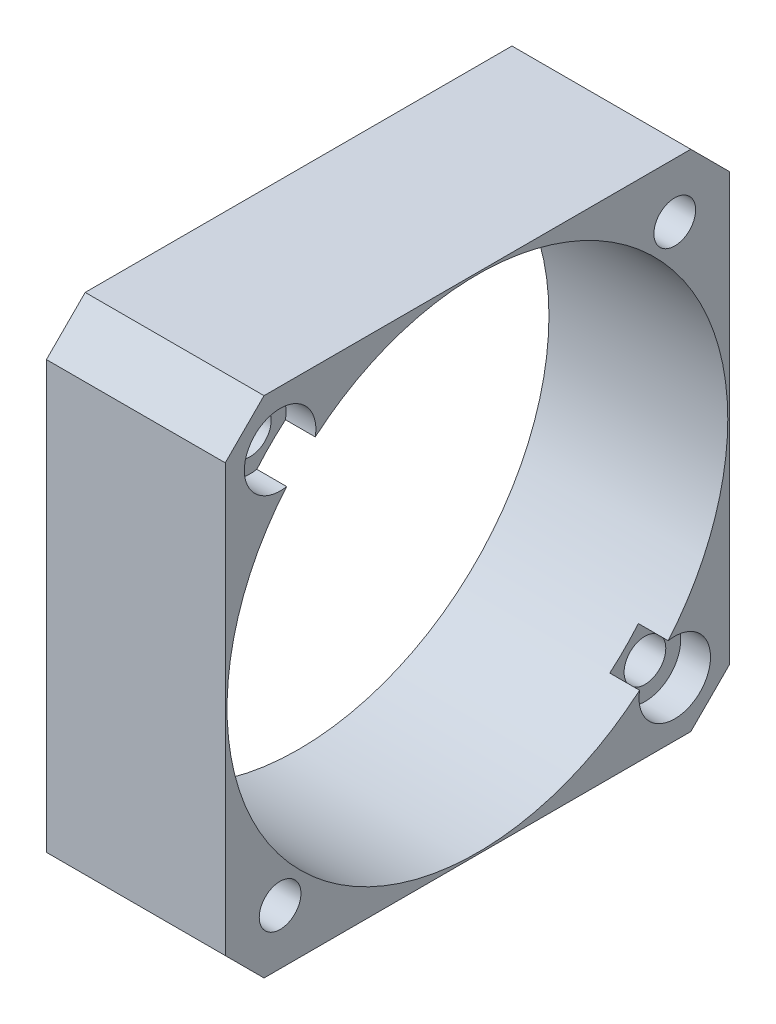
ISO-10303-21;
HEADER;
FILE_DESCRIPTION(('STEP AP214'),'2;1');
FILE_NAME('part.step','',(''),(''),'','','');
FILE_SCHEMA(('AUTOMOTIVE_DESIGN { 1 0 10303 214 1 1 1 1 }'));
ENDSEC;
DATA;
#1=APPLICATION_CONTEXT('core data for automotive mechanical design processes');
#2=APPLICATION_PROTOCOL_DEFINITION('international standard','automotive_design',2000,#1);
#3=PRODUCT_CONTEXT('',#1,'mechanical');
#4=PRODUCT('Part','Part','',(#3));
#5=PRODUCT_RELATED_PRODUCT_CATEGORY('part','',(#4));
#6=PRODUCT_DEFINITION_FORMATION('','',#4);
#7=PRODUCT_DEFINITION_CONTEXT('part definition',#1,'design');
#8=PRODUCT_DEFINITION('design','',#6,#7);
#9=PRODUCT_DEFINITION_SHAPE('','',#8);
#10=(LENGTH_UNIT() NAMED_UNIT(*) SI_UNIT(.MILLI.,.METRE.));
#11=(NAMED_UNIT(*) PLANE_ANGLE_UNIT() SI_UNIT($,.RADIAN.));
#12=(NAMED_UNIT(*) SI_UNIT($,.STERADIAN.) SOLID_ANGLE_UNIT());
#13=UNCERTAINTY_MEASURE_WITH_UNIT(LENGTH_MEASURE(1.E-05),#10,'distance_accuracy_value','');
#14=(GEOMETRIC_REPRESENTATION_CONTEXT(3) GLOBAL_UNCERTAINTY_ASSIGNED_CONTEXT((#13)) GLOBAL_UNIT_ASSIGNED_CONTEXT((#10,
#11,#12)) REPRESENTATION_CONTEXT('',''));
#15=CARTESIAN_POINT('',(0.,0.,0.));
#16=DIRECTION('',(0.,0.,1.));
#17=DIRECTION('',(1.,0.,0.));
#18=AXIS2_PLACEMENT_3D('',#15,#16,#17);
#19=CARTESIAN_POINT('',(-18.2228778596732,16.51656247788,24.8694653146279));
#20=DIRECTION('',(1.,0.,0.));
#21=DIRECTION('',(0.,0.,-1.));
#22=AXIS2_PLACEMENT_3D('',#19,#20,#21);
#23=CYLINDRICAL_SURFACE('',#22,1.75);
#24=CARTESIAN_POINT('',(-23.2228778596732,16.51656247788,24.8694653146279));
#25=DIRECTION('',(-1.,0.,0.));
#26=DIRECTION('',(0.,0.,1.));
#27=AXIS2_PLACEMENT_3D('',#24,#25,#26);
#28=CIRCLE('',#27,1.75);
#29=CARTESIAN_POINT('',(-23.2228778596732,16.51656247788,26.6194653146279));
#30=VERTEX_POINT('',#29);
#31=EDGE_CURVE('E153',#30,#30,#28,.T.);
#32=ORIENTED_EDGE('',*,*,#31,.T.);
#33=EDGE_LOOP('',(#32));
#34=FACE_BOUND('',#33,.T.);
#35=CARTESIAN_POINT('',(-10.7228778596732,16.51656247788,24.8694653146279));
#36=DIRECTION('',(1.,0.,0.));
#37=DIRECTION('',(0.,0.,-1.));
#38=AXIS2_PLACEMENT_3D('',#35,#36,#37);
#39=CIRCLE('',#38,1.75);
#40=CARTESIAN_POINT('',(-10.7228778596732,16.51656247788,23.1194653146279));
#41=VERTEX_POINT('',#40);
#42=EDGE_CURVE('E157',#41,#41,#39,.F.);
#43=ORIENTED_EDGE('',*,*,#42,.F.);
#44=EDGE_LOOP('',(#43));
#45=FACE_BOUND('',#44,.T.);
#46=ADVANCED_FACE('F36',(#34,#45),#23,.F.);
#47=CARTESIAN_POINT('',(-18.2228778596732,-16.5834375221197,-8.23053468537245));
#48=DIRECTION('',(1.,0.,0.));
#49=DIRECTION('',(0.,0.,-1.));
#50=AXIS2_PLACEMENT_3D('',#47,#48,#49);
#51=CYLINDRICAL_SURFACE('',#50,1.75);
#52=CARTESIAN_POINT('',(-23.2228778596732,-16.5834375221197,-8.23053468537245));
#53=DIRECTION('',(-1.,0.,0.));
#54=DIRECTION('',(0.,0.,1.));
#55=AXIS2_PLACEMENT_3D('',#52,#53,#54);
#56=CIRCLE('',#55,1.75);
#57=CARTESIAN_POINT('',(-23.2228778596732,-16.5834375221197,-6.48053468537244));
#58=VERTEX_POINT('',#57);
#59=EDGE_CURVE('E160',#58,#58,#56,.T.);
#60=ORIENTED_EDGE('',*,*,#59,.T.);
#61=EDGE_LOOP('',(#60));
#62=FACE_BOUND('',#61,.T.);
#63=CARTESIAN_POINT('',(-10.7228778596732,-16.5834375221197,-8.23053468537245));
#64=DIRECTION('',(1.,0.,0.));
#65=DIRECTION('',(0.,0.,-1.));
#66=AXIS2_PLACEMENT_3D('',#63,#64,#65);
#67=CIRCLE('',#66,1.75);
#68=CARTESIAN_POINT('',(-10.7228778596732,-16.5834375221197,-9.98053468537245));
#69=VERTEX_POINT('',#68);
#70=EDGE_CURVE('E144',#69,#69,#67,.F.);
#71=ORIENTED_EDGE('',*,*,#70,.F.);
#72=EDGE_LOOP('',(#71));
#73=FACE_BOUND('',#72,.T.);
#74=ADVANCED_FACE('F260',(#62,#73),#51,.F.);
#75=CARTESIAN_POINT('',(-8.22287785967319,-0.0334375221200389,-8.6805346853721));
#76=DIRECTION('',(-1.,0.,0.));
#77=DIRECTION('',(0.,0.,1.));
#78=AXIS2_PLACEMENT_3D('',#75,#76,#77);
#79=PLANE('',#78);
#80=CARTESIAN_POINT('',(-8.22287785967319,16.51656247788,24.8694653146279));
#81=DIRECTION('',(1.,0.,0.));
#82=DIRECTION('',(0.,0.,-1.));
#83=AXIS2_PLACEMENT_3D('',#80,#81,#82);
#84=CIRCLE('',#83,3.);
#85=CARTESIAN_POINT('',(-8.22287785967319,15.9671916901266,21.9201956189976));
#86=VERTEX_POINT('',#85);
#87=CARTESIAN_POINT('',(-8.22287785967319,13.5672927822497,24.3200945268745));
#88=VERTEX_POINT('',#87);
#89=EDGE_CURVE('E137',#86,#88,#84,.T.);
#90=ORIENTED_EDGE('',*,*,#89,.F.);
#91=CARTESIAN_POINT('',(-8.22287785967319,-0.0334375221200389,8.31946531462791));
#92=DIRECTION('',(1.,0.,0.));
#93=DIRECTION('',(0.,0.,-1.));
#94=AXIS2_PLACEMENT_3D('',#91,#92,#93);
#95=CIRCLE('',#94,21.);
#96=CARTESIAN_POINT('',(-8.22287785967319,-13.6341678264894,-7.68116389761898));
#97=VERTEX_POINT('',#96);
#98=EDGE_CURVE('E123',#97,#86,#95,.T.);
#99=ORIENTED_EDGE('',*,*,#98,.F.);
#100=CARTESIAN_POINT('',(-8.22287785967319,-16.5834375221197,-8.23053468537245));
#101=DIRECTION('',(1.,0.,0.));
#102=DIRECTION('',(0.,0.,-1.));
#103=AXIS2_PLACEMENT_3D('',#100,#101,#102);
#104=CIRCLE('',#103,3.);
#105=CARTESIAN_POINT('',(-8.22287785967319,-16.0340667343664,-5.28126498974214));
#106=VERTEX_POINT('',#105);
#107=EDGE_CURVE('E147',#106,#97,#104,.T.);
#108=ORIENTED_EDGE('',*,*,#107,.F.);
#109=EDGE_CURVE('E131',#88,#106,#95,.T.);
#110=ORIENTED_EDGE('',*,*,#109,.F.);
#111=EDGE_LOOP('',(#90,#99,#108,#110));
#112=FACE_BOUND('',#111,.T.);
#113=CARTESIAN_POINT('',(-8.22287785967319,-16.5834375221199,24.8694653146276));
#114=DIRECTION('',(-1.,0.,0.));
#115=DIRECTION('',(0.,0.,1.));
#116=AXIS2_PLACEMENT_3D('',#113,#114,#115);
#117=CIRCLE('',#116,1.75);
#118=CARTESIAN_POINT('',(-8.22287785967319,-16.5834375221199,26.6194653146276));
#119=VERTEX_POINT('',#118);
#120=EDGE_CURVE('E219',#119,#119,#117,.T.);
#121=ORIENTED_EDGE('',*,*,#120,.T.);
#122=EDGE_LOOP('',(#121));
#123=FACE_BOUND('',#122,.T.);
#124=CARTESIAN_POINT('',(-8.22287785967319,16.5165624778804,-8.23053468537216));
#125=DIRECTION('',(-1.,0.,0.));
#126=DIRECTION('',(0.,0.,1.));
#127=AXIS2_PLACEMENT_3D('',#124,#125,#126);
#128=CIRCLE('',#127,1.75);
#129=CARTESIAN_POINT('',(-8.22287785967319,16.5165624778804,-6.48053468537216));
#130=VERTEX_POINT('',#129);
#131=EDGE_CURVE('E215',#130,#130,#128,.T.);
#132=ORIENTED_EDGE('',*,*,#131,.T.);
#133=EDGE_LOOP('',(#132));
#134=FACE_BOUND('',#133,.T.);
#135=DIRECTION('',(0.,1.,0.));
#136=VECTOR('',#135,1.);
#137=CARTESIAN_POINT('',(-8.22287785967319,-21.18343752212,-12.8305346853721));
#138=LINE('',#137,#136);
#139=CARTESIAN_POINT('',(-8.22287785967319,-17.9307463286619,-12.8305346853721));
#140=VERTEX_POINT('',#139);
#141=CARTESIAN_POINT('',(-8.22287785967319,17.8638712844216,-12.8305346853721));
#142=VERTEX_POINT('',#141);
#143=EDGE_CURVE('E228',#140,#142,#138,.T.);
#144=ORIENTED_EDGE('',*,*,#143,.T.);
#145=DIRECTION('',(0.,-0.707106781186555,-0.70710678118654));
#146=VECTOR('',#145,1.);
#147=CARTESIAN_POINT('',(-8.22287785967319,17.8638712844216,-12.8305346853723));
#148=LINE('',#147,#146);
#149=CARTESIAN_POINT('',(-8.22287785967319,21.1165624778798,-9.57784349191421));
#150=VERTEX_POINT('',#149);
#151=EDGE_CURVE('E190',#150,#142,#148,.T.);
#152=ORIENTED_EDGE('',*,*,#151,.F.);
#153=DIRECTION('',(0.,0.,1.));
#154=VECTOR('',#153,1.);
#155=CARTESIAN_POINT('',(-8.22287785967319,21.11656247788,-12.8305346853721));
#156=LINE('',#155,#154);
#157=CARTESIAN_POINT('',(-8.22287785967319,21.11656247788,26.2167741211696));
#158=VERTEX_POINT('',#157);
#159=EDGE_CURVE('E231',#150,#158,#156,.T.);
#160=ORIENTED_EDGE('',*,*,#159,.T.);
#161=DIRECTION('',(0.,0.707106781186542,-0.707106781186553));
#162=VECTOR('',#161,1.);
#163=CARTESIAN_POINT('',(-8.22287785967319,21.1165624778801,26.2167741211696));
#164=LINE('',#163,#162);
#165=CARTESIAN_POINT('',(-8.22287785967319,17.863871284422,29.4694653146278));
#166=VERTEX_POINT('',#165);
#167=EDGE_CURVE('E59',#166,#158,#164,.T.);
#168=ORIENTED_EDGE('',*,*,#167,.F.);
#169=DIRECTION('',(0.,-1.,0.));
#170=VECTOR('',#169,1.);
#171=CARTESIAN_POINT('',(-8.22287785967319,-21.18343752212,29.4694653146279));
#172=LINE('',#171,#170);
#173=CARTESIAN_POINT('',(-8.22287785967319,-17.9307463286618,29.469465314628));
#174=VERTEX_POINT('',#173);
#175=EDGE_CURVE('E222',#166,#174,#172,.T.);
#176=ORIENTED_EDGE('',*,*,#175,.T.);
#177=DIRECTION('',(0.,0.70710678118655,0.707106781186545));
#178=VECTOR('',#177,1.);
#179=CARTESIAN_POINT('',(-8.22287785967319,-17.9307463286618,29.469465314628));
#180=LINE('',#179,#178);
#181=CARTESIAN_POINT('',(-8.22287785967319,-21.18343752212,26.2167741211699));
#182=VERTEX_POINT('',#181);
#183=EDGE_CURVE('E191',#182,#174,#180,.T.);
#184=ORIENTED_EDGE('',*,*,#183,.F.);
#185=DIRECTION('',(0.,0.,-1.));
#186=VECTOR('',#185,1.);
#187=CARTESIAN_POINT('',(-8.22287785967319,-21.18343752212,-12.8305346853721));
#188=LINE('',#187,#186);
#189=CARTESIAN_POINT('',(-8.22287785967319,-21.18343752212,-9.57784349191398));
#190=VERTEX_POINT('',#189);
#191=EDGE_CURVE('E225',#182,#190,#188,.T.);
#192=ORIENTED_EDGE('',*,*,#191,.T.);
#193=DIRECTION('',(0.,-0.707106781186548,0.707106781186548));
#194=VECTOR('',#193,1.);
#195=CARTESIAN_POINT('',(-8.22287785967319,-21.18343752212,-9.57784349191398));
#196=LINE('',#195,#194);
#197=EDGE_CURVE('E198',#140,#190,#196,.T.);
#198=ORIENTED_EDGE('',*,*,#197,.F.);
#199=EDGE_LOOP('',(#144,#152,#160,#168,#176,#184,#192,#198));
#200=FACE_BOUND('',#199,.T.);
#201=ADVANCED_FACE('F38',(#112,#123,#134,#200),#79,.F.);
#202=CARTESIAN_POINT('',(-18.2228778596732,-21.18343752212,29.4694653146279));
#203=DIRECTION('',(0.,0.,1.));
#204=DIRECTION('',(0.,-1.,0.));
#205=AXIS2_PLACEMENT_3D('',#202,#203,#204);
#206=PLANE('',#205);
#207=DIRECTION('',(1.,0.,0.));
#208=VECTOR('',#207,1.);
#209=CARTESIAN_POINT('',(-18.2228778596732,17.863871284422,29.4694653146278));
#210=LINE('',#209,#208);
#211=CARTESIAN_POINT('',(-23.2228778596732,17.863871284422,29.4694653146278));
#212=VERTEX_POINT('',#211);
#213=EDGE_CURVE('E201',#212,#166,#210,.T.);
#214=ORIENTED_EDGE('',*,*,#213,.F.);
#215=DIRECTION('',(0.,1.,0.));
#216=VECTOR('',#215,1.);
#217=CARTESIAN_POINT('',(-23.2228778596732,-17.9307463286618,29.469465314628));
#218=LINE('',#217,#216);
#219=CARTESIAN_POINT('',(-23.2228778596732,-17.9307463286618,29.469465314628));
#220=VERTEX_POINT('',#219);
#221=EDGE_CURVE('E181',#220,#212,#218,.T.);
#222=ORIENTED_EDGE('',*,*,#221,.F.);
#223=DIRECTION('',(1.,0.,0.));
#224=VECTOR('',#223,1.);
#225=CARTESIAN_POINT('',(-18.2228778596732,-17.9307463286618,29.469465314628));
#226=LINE('',#225,#224);
#227=EDGE_CURVE('E195',#220,#174,#226,.T.);
#228=ORIENTED_EDGE('',*,*,#227,.T.);
#229=ORIENTED_EDGE('',*,*,#175,.F.);
#230=EDGE_LOOP('',(#214,#222,#228,#229));
#231=FACE_BOUND('',#230,.T.);
#232=ADVANCED_FACE('F269',(#231),#206,.T.);
#233=CARTESIAN_POINT('',(-18.2228778596732,21.11656247788,-12.8305346853721));
#234=DIRECTION('',(0.,1.,0.));
#235=DIRECTION('',(0.,0.,1.));
#236=AXIS2_PLACEMENT_3D('',#233,#234,#235);
#237=PLANE('',#236);
#238=DIRECTION('',(1.,0.,0.));
#239=VECTOR('',#238,1.);
#240=CARTESIAN_POINT('',(-18.2228778596732,21.1165624778798,-9.57784349191421));
#241=LINE('',#240,#239);
#242=CARTESIAN_POINT('',(-23.2228778596732,21.1165624778798,-9.57784349191421));
#243=VERTEX_POINT('',#242);
#244=EDGE_CURVE('E206',#243,#150,#241,.T.);
#245=ORIENTED_EDGE('',*,*,#244,.F.);
#246=DIRECTION('',(0.,0.,-1.));
#247=VECTOR('',#246,1.);
#248=CARTESIAN_POINT('',(-23.2228778596732,21.1165624778801,26.2167741211696));
#249=LINE('',#248,#247);
#250=CARTESIAN_POINT('',(-23.2228778596732,21.1165624778801,26.2167741211696));
#251=VERTEX_POINT('',#250);
#252=EDGE_CURVE('E187',#251,#243,#249,.T.);
#253=ORIENTED_EDGE('',*,*,#252,.F.);
#254=DIRECTION('',(1.,0.,0.));
#255=VECTOR('',#254,1.);
#256=CARTESIAN_POINT('',(-18.2228778596732,21.1165624778801,26.2167741211696));
#257=LINE('',#256,#255);
#258=EDGE_CURVE('E194',#251,#158,#257,.T.);
#259=ORIENTED_EDGE('',*,*,#258,.T.);
#260=ORIENTED_EDGE('',*,*,#159,.F.);
#261=EDGE_LOOP('',(#245,#253,#259,#260));
#262=FACE_BOUND('',#261,.T.);
#263=ADVANCED_FACE('F281',(#262),#237,.T.);
#264=CARTESIAN_POINT('',(-18.2228778596732,-21.18343752212,-12.8305346853721));
#265=DIRECTION('',(0.,0.,-1.));
#266=DIRECTION('',(-1.,0.,0.));
#267=AXIS2_PLACEMENT_3D('',#264,#265,#266);
#268=PLANE('',#267);
#269=DIRECTION('',(1.,0.,0.));
#270=VECTOR('',#269,1.);
#271=CARTESIAN_POINT('',(-18.2228778596732,17.8638712844216,-12.8305346853723));
#272=LINE('',#271,#270);
#273=CARTESIAN_POINT('',(-23.2228778596732,17.8638712844216,-12.8305346853723));
#274=VERTEX_POINT('',#273);
#275=EDGE_CURVE('E202',#274,#142,#272,.T.);
#276=ORIENTED_EDGE('',*,*,#275,.T.);
#277=ORIENTED_EDGE('',*,*,#143,.F.);
#278=DIRECTION('',(1.,0.,0.));
#279=VECTOR('',#278,1.);
#280=CARTESIAN_POINT('',(-18.2228778596732,-17.9307463286619,-12.8305346853721));
#281=LINE('',#280,#279);
#282=CARTESIAN_POINT('',(-23.2228778596732,-17.9307463286619,-12.8305346853721));
#283=VERTEX_POINT('',#282);
#284=EDGE_CURVE('E211',#283,#140,#281,.T.);
#285=ORIENTED_EDGE('',*,*,#284,.F.);
#286=DIRECTION('',(0.,-1.,0.));
#287=VECTOR('',#286,1.);
#288=CARTESIAN_POINT('',(-23.2228778596732,17.8638712844216,-12.8305346853723));
#289=LINE('',#288,#287);
#290=EDGE_CURVE('E169',#274,#283,#289,.T.);
#291=ORIENTED_EDGE('',*,*,#290,.F.);
#292=EDGE_LOOP('',(#276,#277,#285,#291));
#293=FACE_BOUND('',#292,.T.);
#294=ADVANCED_FACE('F284',(#293),#268,.T.);
#295=CARTESIAN_POINT('',(-18.2228778596732,-21.18343752212,-12.8305346853721));
#296=DIRECTION('',(0.,-1.,0.));
#297=DIRECTION('',(0.,0.,-1.));
#298=AXIS2_PLACEMENT_3D('',#295,#296,#297);
#299=PLANE('',#298);
#300=DIRECTION('',(1.,0.,0.));
#301=VECTOR('',#300,1.);
#302=CARTESIAN_POINT('',(-18.2228778596732,-21.18343752212,26.2167741211699));
#303=LINE('',#302,#301);
#304=CARTESIAN_POINT('',(-23.2228778596732,-21.18343752212,26.2167741211699));
#305=VERTEX_POINT('',#304);
#306=EDGE_CURVE('E193',#305,#182,#303,.T.);
#307=ORIENTED_EDGE('',*,*,#306,.F.);
#308=DIRECTION('',(0.,0.,1.));
#309=VECTOR('',#308,1.);
#310=CARTESIAN_POINT('',(-23.2228778596732,-21.18343752212,-9.57784349191398));
#311=LINE('',#310,#309);
#312=CARTESIAN_POINT('',(-23.2228778596732,-21.18343752212,-9.57784349191398));
#313=VERTEX_POINT('',#312);
#314=EDGE_CURVE('E175',#313,#305,#311,.T.);
#315=ORIENTED_EDGE('',*,*,#314,.F.);
#316=DIRECTION('',(1.,0.,0.));
#317=VECTOR('',#316,1.);
#318=CARTESIAN_POINT('',(-18.2228778596732,-21.18343752212,-9.57784349191398));
#319=LINE('',#318,#317);
#320=EDGE_CURVE('E212',#313,#190,#319,.T.);
#321=ORIENTED_EDGE('',*,*,#320,.T.);
#322=ORIENTED_EDGE('',*,*,#191,.F.);
#323=EDGE_LOOP('',(#307,#315,#321,#322));
#324=FACE_BOUND('',#323,.T.);
#325=ADVANCED_FACE('F288',(#324),#299,.T.);
#326=CARTESIAN_POINT('',(-18.2228778596732,16.5165624778804,-8.23053468537216));
#327=DIRECTION('',(1.,0.,0.));
#328=DIRECTION('',(0.,0.,-1.));
#329=AXIS2_PLACEMENT_3D('',#326,#327,#328);
#330=CYLINDRICAL_SURFACE('',#329,1.75);
#331=ORIENTED_EDGE('',*,*,#131,.F.);
#332=EDGE_LOOP('',(#331));
#333=FACE_BOUND('',#332,.T.);
#334=CARTESIAN_POINT('',(-23.2228778596732,16.5165624778804,-8.23053468537216));
#335=DIRECTION('',(-1.,0.,0.));
#336=DIRECTION('',(0.,0.,1.));
#337=AXIS2_PLACEMENT_3D('',#334,#335,#336);
#338=CIRCLE('',#337,1.75);
#339=CARTESIAN_POINT('',(-23.2228778596732,16.5165624778804,-6.48053468537216));
#340=VERTEX_POINT('',#339);
#341=EDGE_CURVE('E163',#340,#340,#338,.T.);
#342=ORIENTED_EDGE('',*,*,#341,.T.);
#343=EDGE_LOOP('',(#342));
#344=FACE_BOUND('',#343,.T.);
#345=ADVANCED_FACE('F274',(#333,#344),#330,.F.);
#346=CARTESIAN_POINT('',(-18.2228778596732,-16.5834375221199,24.8694653146276));
#347=DIRECTION('',(1.,0.,0.));
#348=DIRECTION('',(0.,0.,-1.));
#349=AXIS2_PLACEMENT_3D('',#346,#347,#348);
#350=CYLINDRICAL_SURFACE('',#349,1.75);
#351=ORIENTED_EDGE('',*,*,#120,.F.);
#352=EDGE_LOOP('',(#351));
#353=FACE_BOUND('',#352,.T.);
#354=CARTESIAN_POINT('',(-23.2228778596732,-16.5834375221199,24.8694653146276));
#355=DIRECTION('',(-1.,0.,0.));
#356=DIRECTION('',(0.,0.,1.));
#357=AXIS2_PLACEMENT_3D('',#354,#355,#356);
#358=CIRCLE('',#357,1.75);
#359=CARTESIAN_POINT('',(-23.2228778596732,-16.5834375221199,26.6194653146276));
#360=VERTEX_POINT('',#359);
#361=EDGE_CURVE('E156',#360,#360,#358,.T.);
#362=ORIENTED_EDGE('',*,*,#361,.T.);
#363=EDGE_LOOP('',(#362));
#364=FACE_BOUND('',#363,.T.);
#365=ADVANCED_FACE('F276',(#353,#364),#350,.F.);
#366=CARTESIAN_POINT('',(-18.2228778596732,-21.18343752212,-9.57784349191398));
#367=DIRECTION('',(0.,0.707106781186548,0.707106781186548));
#368=DIRECTION('',(0.,-0.707106781186548,0.707106781186548));
#369=AXIS2_PLACEMENT_3D('',#366,#367,#368);
#370=PLANE('',#369);
#371=ORIENTED_EDGE('',*,*,#197,.T.);
#372=ORIENTED_EDGE('',*,*,#320,.F.);
#373=DIRECTION('',(0.,-0.707106781186548,0.707106781186548));
#374=VECTOR('',#373,1.);
#375=CARTESIAN_POINT('',(-23.2228778596732,-17.9307463286619,-12.8305346853721));
#376=LINE('',#375,#374);
#377=EDGE_CURVE('E172',#283,#313,#376,.T.);
#378=ORIENTED_EDGE('',*,*,#377,.F.);
#379=ORIENTED_EDGE('',*,*,#284,.T.);
#380=EDGE_LOOP('',(#371,#372,#378,#379));
#381=FACE_BOUND('',#380,.T.);
#382=ADVANCED_FACE('F278',(#381),#370,.F.);
#383=CARTESIAN_POINT('',(-18.2228778596732,-17.9307463286618,29.469465314628));
#384=DIRECTION('',(0.,0.707106781186545,-0.70710678118655));
#385=DIRECTION('',(0.,0.70710678118655,0.707106781186545));
#386=AXIS2_PLACEMENT_3D('',#383,#384,#385);
#387=PLANE('',#386);
#388=ORIENTED_EDGE('',*,*,#183,.T.);
#389=ORIENTED_EDGE('',*,*,#227,.F.);
#390=DIRECTION('',(0.,0.707106781186558,0.707106781186537));
#391=VECTOR('',#390,1.);
#392=CARTESIAN_POINT('',(-23.2228778596732,-21.18343752212,26.2167741211699));
#393=LINE('',#392,#391);
#394=EDGE_CURVE('E178',#305,#220,#393,.T.);
#395=ORIENTED_EDGE('',*,*,#394,.F.);
#396=ORIENTED_EDGE('',*,*,#306,.T.);
#397=EDGE_LOOP('',(#388,#389,#395,#396));
#398=FACE_BOUND('',#397,.T.);
#399=ADVANCED_FACE('F319',(#398),#387,.F.);
#400=CARTESIAN_POINT('',(-18.2228778596732,17.8638712844216,-12.8305346853723));
#401=DIRECTION('',(0.,-0.70710678118654,0.707106781186555));
#402=DIRECTION('',(0.,-0.707106781186555,-0.70710678118654));
#403=AXIS2_PLACEMENT_3D('',#400,#401,#402);
#404=PLANE('',#403);
#405=ORIENTED_EDGE('',*,*,#151,.T.);
#406=ORIENTED_EDGE('',*,*,#275,.F.);
#407=DIRECTION('',(0.,-0.707106781186555,-0.70710678118654));
#408=VECTOR('',#407,1.);
#409=CARTESIAN_POINT('',(-23.2228778596732,21.1165624778798,-9.57784349191421));
#410=LINE('',#409,#408);
#411=EDGE_CURVE('E166',#243,#274,#410,.T.);
#412=ORIENTED_EDGE('',*,*,#411,.F.);
#413=ORIENTED_EDGE('',*,*,#244,.T.);
#414=EDGE_LOOP('',(#405,#406,#412,#413));
#415=FACE_BOUND('',#414,.T.);
#416=ADVANCED_FACE('F310',(#415),#404,.F.);
#417=CARTESIAN_POINT('',(-18.2228778596732,21.1165624778801,26.2167741211696));
#418=DIRECTION('',(0.,-0.707106781186553,-0.707106781186542));
#419=DIRECTION('',(0.,0.707106781186542,-0.707106781186553));
#420=AXIS2_PLACEMENT_3D('',#417,#418,#419);
#421=PLANE('',#420);
#422=ORIENTED_EDGE('',*,*,#167,.T.);
#423=ORIENTED_EDGE('',*,*,#258,.F.);
#424=DIRECTION('',(0.,0.707106781186542,-0.707106781186553));
#425=VECTOR('',#424,1.);
#426=CARTESIAN_POINT('',(-23.2228778596732,17.863871284422,29.4694653146278));
#427=LINE('',#426,#425);
#428=EDGE_CURVE('E184',#212,#251,#427,.T.);
#429=ORIENTED_EDGE('',*,*,#428,.F.);
#430=ORIENTED_EDGE('',*,*,#213,.T.);
#431=EDGE_LOOP('',(#422,#423,#429,#430));
#432=FACE_BOUND('',#431,.T.);
#433=ADVANCED_FACE('F303',(#432),#421,.F.);
#434=CARTESIAN_POINT('',(-23.2228778596732,0.,0.));
#435=DIRECTION('',(-1.,0.,0.));
#436=DIRECTION('',(0.,0.,1.));
#437=AXIS2_PLACEMENT_3D('',#434,#435,#436);
#438=PLANE('',#437);
#439=CARTESIAN_POINT('',(-23.2228778596732,-0.0334375221200389,8.31946531462791));
#440=DIRECTION('',(1.,0.,0.));
#441=DIRECTION('',(0.,0.,-1.));
#442=AXIS2_PLACEMENT_3D('',#439,#440,#441);
#443=CIRCLE('',#442,21.);
#444=CARTESIAN_POINT('',(-23.2228778596732,-0.0334375221200389,-12.6805346853721));
#445=VERTEX_POINT('',#444);
#446=EDGE_CURVE('E240',#445,#445,#443,.T.);
#447=ORIENTED_EDGE('',*,*,#446,.T.);
#448=EDGE_LOOP('',(#447));
#449=FACE_BOUND('',#448,.T.);
#450=ORIENTED_EDGE('',*,*,#361,.F.);
#451=EDGE_LOOP('',(#450));
#452=FACE_BOUND('',#451,.T.);
#453=ORIENTED_EDGE('',*,*,#341,.F.);
#454=EDGE_LOOP('',(#453));
#455=FACE_BOUND('',#454,.T.);
#456=ORIENTED_EDGE('',*,*,#411,.T.);
#457=ORIENTED_EDGE('',*,*,#290,.T.);
#458=ORIENTED_EDGE('',*,*,#377,.T.);
#459=ORIENTED_EDGE('',*,*,#314,.T.);
#460=ORIENTED_EDGE('',*,*,#394,.T.);
#461=ORIENTED_EDGE('',*,*,#221,.T.);
#462=ORIENTED_EDGE('',*,*,#428,.T.);
#463=ORIENTED_EDGE('',*,*,#252,.T.);
#464=EDGE_LOOP('',(#456,#457,#458,#459,#460,#461,#462,#463));
#465=FACE_BOUND('',#464,.T.);
#466=ORIENTED_EDGE('',*,*,#59,.F.);
#467=EDGE_LOOP('',(#466));
#468=FACE_BOUND('',#467,.T.);
#469=ORIENTED_EDGE('',*,*,#31,.F.);
#470=EDGE_LOOP('',(#469));
#471=FACE_BOUND('',#470,.T.);
#472=ADVANCED_FACE('F256',(#449,#452,#455,#465,#468,#471),#438,.T.);
#473=CARTESIAN_POINT('',(-10.7228778596732,-16.5834375221197,-8.23053468537245));
#474=DIRECTION('',(1.,0.,0.));
#475=DIRECTION('',(0.,0.,-1.));
#476=AXIS2_PLACEMENT_3D('',#473,#474,#475);
#477=PLANE('',#476);
#478=CARTESIAN_POINT('',(-10.7228778596732,-0.0334375221200389,8.31946531462791));
#479=DIRECTION('',(1.,0.,0.));
#480=DIRECTION('',(0.,0.,-1.));
#481=AXIS2_PLACEMENT_3D('',#478,#479,#480);
#482=CIRCLE('',#481,21.);
#483=CARTESIAN_POINT('',(-10.7228778596732,-16.0340667343664,-5.28126498974214));
#484=VERTEX_POINT('',#483);
#485=CARTESIAN_POINT('',(-10.7228778596732,-13.6341678264894,-7.68116389761898));
#486=VERTEX_POINT('',#485);
#487=EDGE_CURVE('E242',#484,#486,#482,.T.);
#488=ORIENTED_EDGE('',*,*,#487,.F.);
#489=CARTESIAN_POINT('',(-10.7228778596732,-16.5834375221197,-8.23053468537245));
#490=DIRECTION('',(1.,0.,0.));
#491=DIRECTION('',(0.,0.,-1.));
#492=AXIS2_PLACEMENT_3D('',#489,#490,#491);
#493=CIRCLE('',#492,3.);
#494=EDGE_CURVE('E142',#484,#486,#493,.T.);
#495=ORIENTED_EDGE('',*,*,#494,.T.);
#496=EDGE_LOOP('',(#488,#495));
#497=FACE_BOUND('',#496,.T.);
#498=ORIENTED_EDGE('',*,*,#70,.T.);
#499=EDGE_LOOP('',(#498));
#500=FACE_BOUND('',#499,.T.);
#501=ADVANCED_FACE('F253',(#497,#500),#477,.T.);
#502=CARTESIAN_POINT('',(-10.7228778596732,-16.5834375221197,-8.23053468537245));
#503=DIRECTION('',(1.,0.,0.));
#504=DIRECTION('',(0.,0.,-1.));
#505=AXIS2_PLACEMENT_3D('',#502,#503,#504);
#506=CYLINDRICAL_SURFACE('',#505,3.);
#507=ORIENTED_EDGE('',*,*,#494,.F.);
#508=DIRECTION('',(1.,0.,0.));
#509=VECTOR('',#508,1.);
#510=CARTESIAN_POINT('',(-15.7228778596732,-16.0340667343664,-5.28126498974214));
#511=LINE('',#510,#509);
#512=EDGE_CURVE('E152',#484,#106,#511,.T.);
#513=ORIENTED_EDGE('',*,*,#512,.T.);
#514=ORIENTED_EDGE('',*,*,#107,.T.);
#515=DIRECTION('',(1.,0.,0.));
#516=VECTOR('',#515,1.);
#517=CARTESIAN_POINT('',(-15.7228778596732,-13.6341678264894,-7.68116389761898));
#518=LINE('',#517,#516);
#519=EDGE_CURVE('E126',#97,#486,#518,.F.);
#520=ORIENTED_EDGE('',*,*,#519,.T.);
#521=EDGE_LOOP('',(#507,#513,#514,#520));
#522=FACE_BOUND('',#521,.T.);
#523=ADVANCED_FACE('F250',(#522),#506,.F.);
#524=CARTESIAN_POINT('',(-10.7228778596732,16.51656247788,24.8694653146279));
#525=DIRECTION('',(1.,0.,0.));
#526=DIRECTION('',(0.,0.,-1.));
#527=AXIS2_PLACEMENT_3D('',#524,#525,#526);
#528=PLANE('',#527);
#529=CARTESIAN_POINT('',(-10.7228778596732,-0.0334375221200389,8.31946531462791));
#530=DIRECTION('',(1.,0.,0.));
#531=DIRECTION('',(0.,0.,-1.));
#532=AXIS2_PLACEMENT_3D('',#529,#530,#531);
#533=CIRCLE('',#532,21.);
#534=CARTESIAN_POINT('',(-10.7228778596732,15.9671916901266,21.9201956189976));
#535=VERTEX_POINT('',#534);
#536=CARTESIAN_POINT('',(-10.7228778596732,13.5672927822497,24.3200945268745));
#537=VERTEX_POINT('',#536);
#538=EDGE_CURVE('E51',#535,#537,#533,.T.);
#539=ORIENTED_EDGE('',*,*,#538,.F.);
#540=CARTESIAN_POINT('',(-10.7228778596732,16.51656247788,24.8694653146279));
#541=DIRECTION('',(1.,0.,0.));
#542=DIRECTION('',(0.,0.,-1.));
#543=AXIS2_PLACEMENT_3D('',#540,#541,#542);
#544=CIRCLE('',#543,3.);
#545=EDGE_CURVE('E139',#535,#537,#544,.T.);
#546=ORIENTED_EDGE('',*,*,#545,.T.);
#547=EDGE_LOOP('',(#539,#546));
#548=FACE_BOUND('',#547,.T.);
#549=ORIENTED_EDGE('',*,*,#42,.T.);
#550=EDGE_LOOP('',(#549));
#551=FACE_BOUND('',#550,.T.);
#552=ADVANCED_FACE('F238',(#548,#551),#528,.T.);
#553=CARTESIAN_POINT('',(-10.7228778596732,16.51656247788,24.8694653146279));
#554=DIRECTION('',(1.,0.,0.));
#555=DIRECTION('',(0.,0.,-1.));
#556=AXIS2_PLACEMENT_3D('',#553,#554,#555);
#557=CYLINDRICAL_SURFACE('',#556,3.);
#558=ORIENTED_EDGE('',*,*,#545,.F.);
#559=DIRECTION('',(1.,0.,0.));
#560=VECTOR('',#559,1.);
#561=CARTESIAN_POINT('',(-15.7228778596732,15.9671916901266,21.9201956189976));
#562=LINE('',#561,#560);
#563=EDGE_CURVE('E12',#535,#86,#562,.T.);
#564=ORIENTED_EDGE('',*,*,#563,.T.);
#565=ORIENTED_EDGE('',*,*,#89,.T.);
#566=DIRECTION('',(1.,0.,0.));
#567=VECTOR('',#566,1.);
#568=CARTESIAN_POINT('',(-15.7228778596732,13.5672927822497,24.3200945268745));
#569=LINE('',#568,#567);
#570=EDGE_CURVE('E44',#88,#537,#569,.F.);
#571=ORIENTED_EDGE('',*,*,#570,.T.);
#572=EDGE_LOOP('',(#558,#564,#565,#571));
#573=FACE_BOUND('',#572,.T.);
#574=ADVANCED_FACE('F136',(#573),#557,.F.);
#575=CARTESIAN_POINT('',(-23.2228778596732,-0.0334375221200389,8.31946531462791));
#576=DIRECTION('',(1.,0.,0.));
#577=DIRECTION('',(0.,0.,-1.));
#578=AXIS2_PLACEMENT_3D('',#575,#576,#577);
#579=CYLINDRICAL_SURFACE('',#578,21.);
#580=ORIENTED_EDGE('',*,*,#446,.F.);
#581=EDGE_LOOP('',(#580));
#582=FACE_BOUND('',#581,.T.);
#583=ORIENTED_EDGE('',*,*,#487,.T.);
#584=ORIENTED_EDGE('',*,*,#519,.F.);
#585=ORIENTED_EDGE('',*,*,#98,.T.);
#586=ORIENTED_EDGE('',*,*,#563,.F.);
#587=ORIENTED_EDGE('',*,*,#538,.T.);
#588=ORIENTED_EDGE('',*,*,#570,.F.);
#589=ORIENTED_EDGE('',*,*,#109,.T.);
#590=ORIENTED_EDGE('',*,*,#512,.F.);
#591=EDGE_LOOP('',(#583,#584,#585,#586,#587,#588,#589,#590));
#592=FACE_BOUND('',#591,.T.);
#593=ADVANCED_FACE('F124',(#582,#592),#579,.F.);
#594=CLOSED_SHELL('',(#46,#74,#201,#232,#263,#294,#325,#345,#365,#382,#399,#416,#433,#472,#501,
#523,#552,#574,#593));
#595=MANIFOLD_SOLID_BREP('B2',#594);
#596=ADVANCED_BREP_SHAPE_REPRESENTATION('',(#18,#595),#14);
#597=SHAPE_DEFINITION_REPRESENTATION(#9,#596);
ENDSEC;
END-ISO-10303-21;
